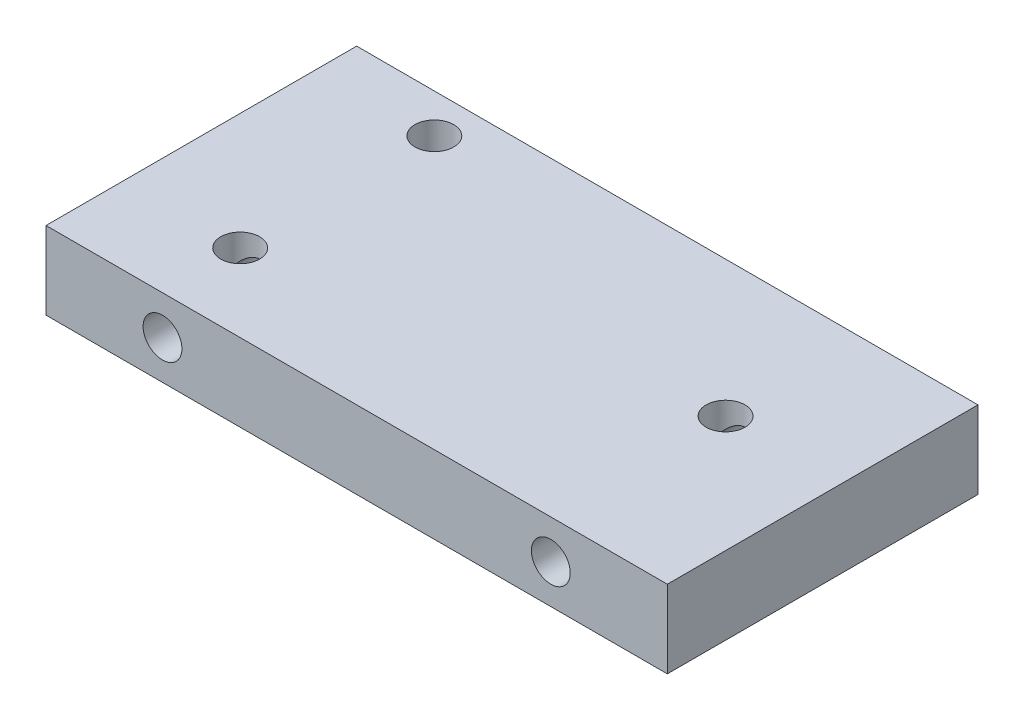
ISO-10303-21;
HEADER;
FILE_DESCRIPTION(('STEP AP214'),'2;1');
FILE_NAME('part.step','',(''),(''),'','','');
FILE_SCHEMA(('AUTOMOTIVE_DESIGN { 1 0 10303 214 1 1 1 1 }'));
ENDSEC;
DATA;
#1=APPLICATION_CONTEXT('core data for automotive mechanical design processes');
#2=APPLICATION_PROTOCOL_DEFINITION('international standard','automotive_design',2000,#1);
#3=PRODUCT_CONTEXT('',#1,'mechanical');
#4=PRODUCT('Part','Part','',(#3));
#5=PRODUCT_RELATED_PRODUCT_CATEGORY('part','',(#4));
#6=PRODUCT_DEFINITION_FORMATION('','',#4);
#7=PRODUCT_DEFINITION_CONTEXT('part definition',#1,'design');
#8=PRODUCT_DEFINITION('design','',#6,#7);
#9=PRODUCT_DEFINITION_SHAPE('','',#8);
#10=(LENGTH_UNIT() NAMED_UNIT(*) SI_UNIT(.MILLI.,.METRE.));
#11=(NAMED_UNIT(*) PLANE_ANGLE_UNIT() SI_UNIT($,.RADIAN.));
#12=(NAMED_UNIT(*) SI_UNIT($,.STERADIAN.) SOLID_ANGLE_UNIT());
#13=UNCERTAINTY_MEASURE_WITH_UNIT(LENGTH_MEASURE(1.E-05),#10,'distance_accuracy_value','');
#14=(GEOMETRIC_REPRESENTATION_CONTEXT(3) GLOBAL_UNCERTAINTY_ASSIGNED_CONTEXT((#13)) GLOBAL_UNIT_ASSIGNED_CONTEXT((#10,
#11,#12)) REPRESENTATION_CONTEXT('',''));
#15=CARTESIAN_POINT('',(0.,0.,0.));
#16=DIRECTION('',(0.,0.,1.));
#17=DIRECTION('',(1.,0.,0.));
#18=AXIS2_PLACEMENT_3D('',#15,#16,#17);
#19=CARTESIAN_POINT('',(-82.95230410634,25.,-61.5815341004754));
#20=DIRECTION('',(1.,0.,0.));
#21=DIRECTION('',(0.,0.,-1.));
#22=AXIS2_PLACEMENT_3D('',#19,#20,#21);
#23=PLANE('',#22);
#24=DIRECTION('',(0.,0.,1.));
#25=VECTOR('',#24,1.);
#26=CARTESIAN_POINT('',(-82.95230410634,0.,-61.5815341004754));
#27=LINE('',#26,#25);
#28=CARTESIAN_POINT('',(-82.95230410634,0.,-61.5815341004754));
#29=VERTEX_POINT('',#28);
#30=CARTESIAN_POINT('',(-82.95230410634,0.,38.4184658995246));
#31=VERTEX_POINT('',#30);
#32=EDGE_CURVE('E141',#29,#31,#27,.T.);
#33=ORIENTED_EDGE('',*,*,#32,.T.);
#34=DIRECTION('',(0.,-1.,0.));
#35=VECTOR('',#34,1.);
#36=CARTESIAN_POINT('',(-82.95230410634,25.,38.4184658995246));
#37=LINE('',#36,#35);
#38=CARTESIAN_POINT('',(-82.95230410634,25.,38.4184658995246));
#39=VERTEX_POINT('',#38);
#40=EDGE_CURVE('E168',#39,#31,#37,.T.);
#41=ORIENTED_EDGE('',*,*,#40,.F.);
#42=DIRECTION('',(0.,0.,1.));
#43=VECTOR('',#42,1.);
#44=CARTESIAN_POINT('',(-82.95230410634,25.,-61.5815341004754));
#45=LINE('',#44,#43);
#46=CARTESIAN_POINT('',(-82.95230410634,25.,-61.5815341004754));
#47=VERTEX_POINT('',#46);
#48=EDGE_CURVE('E142',#47,#39,#45,.T.);
#49=ORIENTED_EDGE('',*,*,#48,.F.);
#50=DIRECTION('',(0.,-1.,0.));
#51=VECTOR('',#50,1.);
#52=CARTESIAN_POINT('',(-82.95230410634,25.,-61.5815341004754));
#53=LINE('',#52,#51);
#54=EDGE_CURVE('E152',#47,#29,#53,.T.);
#55=ORIENTED_EDGE('',*,*,#54,.T.);
#56=EDGE_LOOP('',(#33,#41,#49,#55));
#57=FACE_BOUND('',#56,.T.);
#58=ADVANCED_FACE('F33',(#57),#23,.F.);
#59=CARTESIAN_POINT('',(-82.95230410634,25.,38.4184658995246));
#60=DIRECTION('',(0.,0.,-1.));
#61=DIRECTION('',(-1.,0.,0.));
#62=AXIS2_PLACEMENT_3D('',#59,#60,#61);
#63=PLANE('',#62);
#64=CARTESIAN_POINT('',(79.54769589366,12.5,38.4184658995246));
#65=DIRECTION('',(0.,0.,1.));
#66=DIRECTION('',(1.,0.,0.));
#67=AXIS2_PLACEMENT_3D('',#64,#65,#66);
#68=CIRCLE('',#67,6.25);
#69=CARTESIAN_POINT('',(85.79769589366,12.5,38.4184658995246));
#70=VERTEX_POINT('',#69);
#71=EDGE_CURVE('E133',#70,#70,#68,.T.);
#72=ORIENTED_EDGE('',*,*,#71,.F.);
#73=EDGE_LOOP('',(#72));
#74=FACE_BOUND('',#73,.T.);
#75=CARTESIAN_POINT('',(-45.45230410634,12.5,38.4184658995246));
#76=DIRECTION('',(0.,0.,1.));
#77=DIRECTION('',(1.,0.,0.));
#78=AXIS2_PLACEMENT_3D('',#75,#76,#77);
#79=CIRCLE('',#78,6.25);
#80=CARTESIAN_POINT('',(-39.20230410634,12.5,38.4184658995246));
#81=VERTEX_POINT('',#80);
#82=EDGE_CURVE('E136',#81,#81,#79,.T.);
#83=ORIENTED_EDGE('',*,*,#82,.F.);
#84=EDGE_LOOP('',(#83));
#85=FACE_BOUND('',#84,.T.);
#86=DIRECTION('',(1.,0.,0.));
#87=VECTOR('',#86,1.);
#88=CARTESIAN_POINT('',(-82.95230410634,0.,38.4184658995246));
#89=LINE('',#88,#87);
#90=CARTESIAN_POINT('',(117.04769589366,0.,38.4184658995246));
#91=VERTEX_POINT('',#90);
#92=EDGE_CURVE('E155',#31,#91,#89,.T.);
#93=ORIENTED_EDGE('',*,*,#92,.T.);
#94=DIRECTION('',(0.,-1.,0.));
#95=VECTOR('',#94,1.);
#96=CARTESIAN_POINT('',(117.04769589366,25.,38.4184658995246));
#97=LINE('',#96,#95);
#98=CARTESIAN_POINT('',(117.04769589366,25.,38.4184658995246));
#99=VERTEX_POINT('',#98);
#100=EDGE_CURVE('E165',#99,#91,#97,.T.);
#101=ORIENTED_EDGE('',*,*,#100,.F.);
#102=DIRECTION('',(1.,0.,0.));
#103=VECTOR('',#102,1.);
#104=CARTESIAN_POINT('',(-82.95230410634,25.,38.4184658995246));
#105=LINE('',#104,#103);
#106=EDGE_CURVE('E145',#39,#99,#105,.T.);
#107=ORIENTED_EDGE('',*,*,#106,.F.);
#108=ORIENTED_EDGE('',*,*,#40,.T.);
#109=EDGE_LOOP('',(#93,#101,#107,#108));
#110=FACE_BOUND('',#109,.T.);
#111=ADVANCED_FACE('F228',(#74,#85,#110),#63,.F.);
#112=CARTESIAN_POINT('',(117.04769589366,25.,-61.5815341004754));
#113=DIRECTION('',(-1.,0.,0.));
#114=DIRECTION('',(0.,0.,1.));
#115=AXIS2_PLACEMENT_3D('',#112,#113,#114);
#116=PLANE('',#115);
#117=DIRECTION('',(0.,0.,-1.));
#118=VECTOR('',#117,1.);
#119=CARTESIAN_POINT('',(117.04769589366,0.,-61.5815341004754));
#120=LINE('',#119,#118);
#121=CARTESIAN_POINT('',(117.04769589366,0.,-61.5815341004754));
#122=VERTEX_POINT('',#121);
#123=EDGE_CURVE('E157',#91,#122,#120,.T.);
#124=ORIENTED_EDGE('',*,*,#123,.T.);
#125=DIRECTION('',(0.,-1.,0.));
#126=VECTOR('',#125,1.);
#127=CARTESIAN_POINT('',(117.04769589366,25.,-61.5815341004754));
#128=LINE('',#127,#126);
#129=CARTESIAN_POINT('',(117.04769589366,25.,-61.5815341004754));
#130=VERTEX_POINT('',#129);
#131=EDGE_CURVE('E162',#130,#122,#128,.T.);
#132=ORIENTED_EDGE('',*,*,#131,.F.);
#133=DIRECTION('',(0.,0.,-1.));
#134=VECTOR('',#133,1.);
#135=CARTESIAN_POINT('',(117.04769589366,25.,-61.5815341004754));
#136=LINE('',#135,#134);
#137=EDGE_CURVE('E148',#99,#130,#136,.T.);
#138=ORIENTED_EDGE('',*,*,#137,.F.);
#139=ORIENTED_EDGE('',*,*,#100,.T.);
#140=EDGE_LOOP('',(#124,#132,#138,#139));
#141=FACE_BOUND('',#140,.T.);
#142=ADVANCED_FACE('F233',(#141),#116,.F.);
#143=CARTESIAN_POINT('',(-82.95230410634,25.,-61.5815341004754));
#144=DIRECTION('',(0.,0.,1.));
#145=DIRECTION('',(1.,0.,0.));
#146=AXIS2_PLACEMENT_3D('',#143,#144,#145);
#147=PLANE('',#146);
#148=DIRECTION('',(-1.,0.,0.));
#149=VECTOR('',#148,1.);
#150=CARTESIAN_POINT('',(-82.95230410634,0.,-61.5815341004754));
#151=LINE('',#150,#149);
#152=EDGE_CURVE('E146',#122,#29,#151,.T.);
#153=ORIENTED_EDGE('',*,*,#152,.T.);
#154=ORIENTED_EDGE('',*,*,#54,.F.);
#155=DIRECTION('',(-1.,0.,0.));
#156=VECTOR('',#155,1.);
#157=CARTESIAN_POINT('',(-82.95230410634,25.,-61.5815341004754));
#158=LINE('',#157,#156);
#159=EDGE_CURVE('E150',#130,#47,#158,.T.);
#160=ORIENTED_EDGE('',*,*,#159,.F.);
#161=ORIENTED_EDGE('',*,*,#131,.T.);
#162=EDGE_LOOP('',(#153,#154,#160,#161));
#163=FACE_BOUND('',#162,.T.);
#164=ADVANCED_FACE('F251',(#163),#147,.F.);
#165=CARTESIAN_POINT('',(0.,25.,0.));
#166=DIRECTION('',(0.,1.,0.));
#167=DIRECTION('',(0.,0.,1.));
#168=AXIS2_PLACEMENT_3D('',#165,#166,#167);
#169=PLANE('',#168);
#170=CARTESIAN_POINT('',(-45.45230410634,25.,-49.0815341004754));
#171=DIRECTION('',(0.,1.,0.));
#172=DIRECTION('',(0.,0.,1.));
#173=AXIS2_PLACEMENT_3D('',#170,#171,#172);
#174=CIRCLE('',#173,6.25);
#175=CARTESIAN_POINT('',(-45.45230410634,25.,-42.8315341004754));
#176=VERTEX_POINT('',#175);
#177=EDGE_CURVE('E113',#176,#176,#174,.T.);
#178=ORIENTED_EDGE('',*,*,#177,.F.);
#179=EDGE_LOOP('',(#178));
#180=FACE_BOUND('',#179,.T.);
#181=CARTESIAN_POINT('',(79.54769589366,25.,-17.8315341004754));
#182=DIRECTION('',(0.,1.,0.));
#183=DIRECTION('',(0.,0.,1.));
#184=AXIS2_PLACEMENT_3D('',#181,#182,#183);
#185=CIRCLE('',#184,6.25);
#186=CARTESIAN_POINT('',(79.54769589366,25.,-11.5815341004754));
#187=VERTEX_POINT('',#186);
#188=EDGE_CURVE('E119',#187,#187,#185,.T.);
#189=ORIENTED_EDGE('',*,*,#188,.F.);
#190=EDGE_LOOP('',(#189));
#191=FACE_BOUND('',#190,.T.);
#192=CARTESIAN_POINT('',(-45.45230410634,25.,13.4184658995246));
#193=DIRECTION('',(0.,1.,0.));
#194=DIRECTION('',(0.,0.,1.));
#195=AXIS2_PLACEMENT_3D('',#192,#193,#194);
#196=CIRCLE('',#195,6.25);
#197=CARTESIAN_POINT('',(-45.45230410634,25.,19.6684658995246));
#198=VERTEX_POINT('',#197);
#199=EDGE_CURVE('E122',#198,#198,#196,.T.);
#200=ORIENTED_EDGE('',*,*,#199,.F.);
#201=EDGE_LOOP('',(#200));
#202=FACE_BOUND('',#201,.T.);
#203=ORIENTED_EDGE('',*,*,#48,.T.);
#204=ORIENTED_EDGE('',*,*,#106,.T.);
#205=ORIENTED_EDGE('',*,*,#137,.T.);
#206=ORIENTED_EDGE('',*,*,#159,.T.);
#207=EDGE_LOOP('',(#203,#204,#205,#206));
#208=FACE_BOUND('',#207,.T.);
#209=ADVANCED_FACE('F247',(#180,#191,#202,#208),#169,.T.);
#210=CARTESIAN_POINT('',(0.,0.,0.));
#211=DIRECTION('',(0.,1.,0.));
#212=DIRECTION('',(0.,0.,1.));
#213=AXIS2_PLACEMENT_3D('',#210,#211,#212);
#214=PLANE('',#213);
#215=ORIENTED_EDGE('',*,*,#32,.F.);
#216=ORIENTED_EDGE('',*,*,#152,.F.);
#217=ORIENTED_EDGE('',*,*,#123,.F.);
#218=ORIENTED_EDGE('',*,*,#92,.F.);
#219=EDGE_LOOP('',(#215,#216,#217,#218));
#220=FACE_BOUND('',#219,.T.);
#221=ADVANCED_FACE('F241',(#220),#214,.F.);
#222=CARTESIAN_POINT('',(-45.45230410634,12.5,-49.0815341004754));
#223=DIRECTION('',(0.,0.,1.));
#224=DIRECTION('',(1.,0.,0.));
#225=AXIS2_PLACEMENT_3D('',#222,#223,#224);
#226=CYLINDRICAL_SURFACE('',#225,6.25);
#227=CARTESIAN_POINT('',(-45.45230410634,12.5,13.4184658995246));
#228=DIRECTION('',(0.,0.707106781186547,0.707106781186547));
#229=DIRECTION('',(0.,-0.707106781186547,0.707106781186547));
#230=AXIS2_PLACEMENT_3D('',#227,#228,#229);
#231=ELLIPSE('',#230,8.83883476483185,6.25);
#232=CARTESIAN_POINT('',(-45.45230410634,6.25,19.6684658995246));
#233=VERTEX_POINT('',#232);
#234=CARTESIAN_POINT('',(-51.70230410634,12.5,13.4184658995246));
#235=VERTEX_POINT('',#234);
#236=EDGE_CURVE('E178',#233,#235,#231,.F.);
#237=ORIENTED_EDGE('',*,*,#236,.T.);
#238=CARTESIAN_POINT('',(-45.45230410634,12.5,13.4184658995246));
#239=DIRECTION('',(0.,-0.707106781186547,0.707106781186547));
#240=DIRECTION('',(0.,0.707106781186547,0.707106781186547));
#241=AXIS2_PLACEMENT_3D('',#238,#239,#240);
#242=ELLIPSE('',#241,8.83883476483185,6.25);
#243=CARTESIAN_POINT('',(-39.20230410634,12.5,13.4184658995246));
#244=VERTEX_POINT('',#243);
#245=EDGE_CURVE('E182',#235,#244,#242,.F.);
#246=ORIENTED_EDGE('',*,*,#245,.T.);
#247=EDGE_CURVE('E181',#244,#233,#231,.F.);
#248=ORIENTED_EDGE('',*,*,#247,.T.);
#249=EDGE_LOOP('',(#237,#246,#248));
#250=FACE_BOUND('',#249,.T.);
#251=ORIENTED_EDGE('',*,*,#82,.T.);
#252=EDGE_LOOP('',(#251));
#253=FACE_BOUND('',#252,.T.);
#254=ADVANCED_FACE('F262',(#250,#253),#226,.F.);
#255=CARTESIAN_POINT('',(79.54769589366,12.5,-49.0815341004754));
#256=DIRECTION('',(0.,0.,1.));
#257=DIRECTION('',(1.,0.,0.));
#258=AXIS2_PLACEMENT_3D('',#255,#256,#257);
#259=CYLINDRICAL_SURFACE('',#258,6.25);
#260=CARTESIAN_POINT('',(79.54769589366,12.5,-17.8315341004754));
#261=DIRECTION('',(0.,0.707106781186547,0.707106781186547));
#262=DIRECTION('',(0.,-0.707106781186547,0.707106781186547));
#263=AXIS2_PLACEMENT_3D('',#260,#261,#262);
#264=ELLIPSE('',#263,8.83883476483185,6.25);
#265=CARTESIAN_POINT('',(79.54769589366,6.25,-11.5815341004754));
#266=VERTEX_POINT('',#265);
#267=CARTESIAN_POINT('',(73.29769589366,12.5,-17.8315341004754));
#268=VERTEX_POINT('',#267);
#269=EDGE_CURVE('E190',#266,#268,#264,.F.);
#270=ORIENTED_EDGE('',*,*,#269,.T.);
#271=CARTESIAN_POINT('',(79.54769589366,12.5,-17.8315341004754));
#272=DIRECTION('',(0.,-0.707106781186547,0.707106781186547));
#273=DIRECTION('',(0.,0.707106781186547,0.707106781186547));
#274=AXIS2_PLACEMENT_3D('',#271,#272,#273);
#275=ELLIPSE('',#274,8.83883476483185,6.25);
#276=CARTESIAN_POINT('',(85.79769589366,12.5,-17.8315341004754));
#277=VERTEX_POINT('',#276);
#278=EDGE_CURVE('E54',#268,#277,#275,.F.);
#279=ORIENTED_EDGE('',*,*,#278,.T.);
#280=EDGE_CURVE('E192',#277,#266,#264,.F.);
#281=ORIENTED_EDGE('',*,*,#280,.T.);
#282=EDGE_LOOP('',(#270,#279,#281));
#283=FACE_BOUND('',#282,.T.);
#284=ORIENTED_EDGE('',*,*,#71,.T.);
#285=EDGE_LOOP('',(#284));
#286=FACE_BOUND('',#285,.T.);
#287=ADVANCED_FACE('F195',(#283,#286),#259,.F.);
#288=CARTESIAN_POINT('',(-45.45230410634,6.25,13.4184658995246));
#289=DIRECTION('',(0.,1.,0.));
#290=DIRECTION('',(0.,0.,1.));
#291=AXIS2_PLACEMENT_3D('',#288,#289,#290);
#292=CYLINDRICAL_SURFACE('',#291,6.25);
#293=ORIENTED_EDGE('',*,*,#199,.T.);
#294=EDGE_LOOP('',(#293));
#295=FACE_BOUND('',#294,.T.);
#296=ORIENTED_EDGE('',*,*,#245,.F.);
#297=CARTESIAN_POINT('',(-45.45230410634,12.5,13.4184658995246));
#298=DIRECTION('',(0.,0.707106781186547,0.707106781186547));
#299=DIRECTION('',(0.,-0.707106781186547,0.707106781186547));
#300=AXIS2_PLACEMENT_3D('',#297,#298,#299);
#301=ELLIPSE('',#300,8.83883476483185,6.25);
#302=EDGE_CURVE('E174',#244,#235,#301,.T.);
#303=ORIENTED_EDGE('',*,*,#302,.F.);
#304=EDGE_LOOP('',(#296,#303));
#305=FACE_BOUND('',#304,.T.);
#306=ADVANCED_FACE('F272',(#295,#305),#292,.F.);
#307=CARTESIAN_POINT('',(-45.45230410634,12.5,-49.0815341004754));
#308=DIRECTION('',(0.,-0.707106781186547,0.707106781186547));
#309=DIRECTION('',(0.,0.707106781186547,0.707106781186547));
#310=AXIS2_PLACEMENT_3D('',#307,#308,#309);
#311=ELLIPSE('',#310,8.83883476483184,6.25);
#312=CARTESIAN_POINT('',(-51.70230410634,12.5,-49.0815341004754));
#313=VERTEX_POINT('',#312);
#314=CARTESIAN_POINT('',(-39.20230410634,12.5,-49.0815341004754));
#315=VERTEX_POINT('',#314);
#316=EDGE_CURVE('E36',#313,#315,#311,.F.);
#317=ORIENTED_EDGE('',*,*,#316,.T.);
#318=CARTESIAN_POINT('',(-45.45230410634,12.5,-49.0815341004754));
#319=DIRECTION('',(0.,0.707106781186547,0.707106781186547));
#320=DIRECTION('',(0.,-0.707106781186547,0.707106781186547));
#321=AXIS2_PLACEMENT_3D('',#318,#319,#320);
#322=ELLIPSE('',#321,8.83883476483184,6.25);
#323=CARTESIAN_POINT('',(-45.45230410634,6.25,-42.8315341004754));
#324=VERTEX_POINT('',#323);
#325=EDGE_CURVE('E11',#315,#324,#322,.F.);
#326=ORIENTED_EDGE('',*,*,#325,.T.);
#327=EDGE_CURVE('E41',#324,#313,#322,.F.);
#328=ORIENTED_EDGE('',*,*,#327,.T.);
#329=EDGE_LOOP('',(#317,#326,#328));
#330=FACE_BOUND('',#329,.T.);
#331=ORIENTED_EDGE('',*,*,#302,.T.);
#332=CARTESIAN_POINT('',(-45.45230410634,12.5,13.4184658995246));
#333=DIRECTION('',(0.,-0.707106781186547,0.707106781186547));
#334=DIRECTION('',(0.,0.707106781186547,0.707106781186547));
#335=AXIS2_PLACEMENT_3D('',#332,#333,#334);
#336=ELLIPSE('',#335,8.83883476483185,6.25);
#337=CARTESIAN_POINT('',(-45.45230410634,6.25,7.16846589952457));
#338=VERTEX_POINT('',#337);
#339=EDGE_CURVE('E175',#235,#338,#336,.T.);
#340=ORIENTED_EDGE('',*,*,#339,.T.);
#341=EDGE_CURVE('E171',#338,#244,#336,.T.);
#342=ORIENTED_EDGE('',*,*,#341,.T.);
#343=EDGE_LOOP('',(#331,#340,#342));
#344=FACE_BOUND('',#343,.T.);
#345=ADVANCED_FACE('F268',(#330,#344),#226,.F.);
#346=CARTESIAN_POINT('',(-45.45230410634,6.25,13.4184658995246));
#347=DIRECTION('',(0.,1.,0.));
#348=DIRECTION('',(0.,0.,1.));
#349=AXIS2_PLACEMENT_3D('',#346,#347,#348);
#350=CIRCLE('',#349,6.25);
#351=EDGE_CURVE('E130',#338,#233,#350,.T.);
#352=ORIENTED_EDGE('',*,*,#351,.F.);
#353=ORIENTED_EDGE('',*,*,#339,.F.);
#354=ORIENTED_EDGE('',*,*,#236,.F.);
#355=EDGE_LOOP('',(#352,#353,#354));
#356=FACE_BOUND('',#355,.T.);
#357=ADVANCED_FACE('F273',(#356),#292,.F.);
#358=ORIENTED_EDGE('',*,*,#341,.F.);
#359=EDGE_CURVE('E126',#233,#338,#350,.T.);
#360=ORIENTED_EDGE('',*,*,#359,.F.);
#361=ORIENTED_EDGE('',*,*,#247,.F.);
#362=EDGE_LOOP('',(#358,#360,#361));
#363=FACE_BOUND('',#362,.T.);
#364=ADVANCED_FACE('F219',(#363),#292,.F.);
#365=CARTESIAN_POINT('',(0.,6.25,0.));
#366=DIRECTION('',(0.,1.,0.));
#367=DIRECTION('',(0.,0.,1.));
#368=AXIS2_PLACEMENT_3D('',#365,#366,#367);
#369=PLANE('',#368);
#370=ORIENTED_EDGE('',*,*,#351,.T.);
#371=ORIENTED_EDGE('',*,*,#359,.T.);
#372=EDGE_LOOP('',(#370,#371));
#373=FACE_BOUND('',#372,.T.);
#374=ADVANCED_FACE('F210',(#373),#369,.T.);
#375=CARTESIAN_POINT('',(79.54769589366,6.25,-17.8315341004754));
#376=DIRECTION('',(0.,1.,0.));
#377=DIRECTION('',(0.,0.,1.));
#378=AXIS2_PLACEMENT_3D('',#375,#376,#377);
#379=CYLINDRICAL_SURFACE('',#378,6.25);
#380=ORIENTED_EDGE('',*,*,#188,.T.);
#381=EDGE_LOOP('',(#380));
#382=FACE_BOUND('',#381,.T.);
#383=ORIENTED_EDGE('',*,*,#278,.F.);
#384=CARTESIAN_POINT('',(79.54769589366,12.5,-17.8315341004754));
#385=DIRECTION('',(0.,0.707106781186547,0.707106781186547));
#386=DIRECTION('',(0.,-0.707106781186547,0.707106781186547));
#387=AXIS2_PLACEMENT_3D('',#384,#385,#386);
#388=ELLIPSE('',#387,8.83883476483185,6.25);
#389=EDGE_CURVE('E187',#277,#268,#388,.T.);
#390=ORIENTED_EDGE('',*,*,#389,.F.);
#391=EDGE_LOOP('',(#383,#390));
#392=FACE_BOUND('',#391,.T.);
#393=ADVANCED_FACE('F207',(#382,#392),#379,.F.);
#394=CARTESIAN_POINT('',(79.54769589366,12.5,-49.0815341004754));
#395=DIRECTION('',(0.,0.,1.));
#396=DIRECTION('',(1.,0.,0.));
#397=AXIS2_PLACEMENT_3D('',#394,#395,#396);
#398=PLANE('',#397);
#399=CARTESIAN_POINT('',(79.54769589366,12.5,-49.0815341004754));
#400=DIRECTION('',(0.,0.,1.));
#401=DIRECTION('',(1.,0.,0.));
#402=AXIS2_PLACEMENT_3D('',#399,#400,#401);
#403=CIRCLE('',#402,6.25);
#404=CARTESIAN_POINT('',(85.79769589366,12.5,-49.0815341004754));
#405=VERTEX_POINT('',#404);
#406=EDGE_CURVE('E129',#405,#405,#403,.T.);
#407=ORIENTED_EDGE('',*,*,#406,.T.);
#408=EDGE_LOOP('',(#407));
#409=FACE_BOUND('',#408,.T.);
#410=ADVANCED_FACE('F209',(#409),#398,.T.);
#411=ORIENTED_EDGE('',*,*,#406,.F.);
#412=EDGE_LOOP('',(#411));
#413=FACE_BOUND('',#412,.T.);
#414=ORIENTED_EDGE('',*,*,#389,.T.);
#415=CARTESIAN_POINT('',(79.54769589366,12.5,-17.8315341004754));
#416=DIRECTION('',(0.,-0.707106781186547,0.707106781186547));
#417=DIRECTION('',(0.,0.707106781186547,0.707106781186547));
#418=AXIS2_PLACEMENT_3D('',#415,#416,#417);
#419=ELLIPSE('',#418,8.83883476483185,6.25);
#420=CARTESIAN_POINT('',(79.54769589366,6.25,-24.0815341004754));
#421=VERTEX_POINT('',#420);
#422=EDGE_CURVE('E110',#268,#421,#419,.T.);
#423=ORIENTED_EDGE('',*,*,#422,.T.);
#424=EDGE_CURVE('E184',#421,#277,#419,.T.);
#425=ORIENTED_EDGE('',*,*,#424,.T.);
#426=EDGE_LOOP('',(#414,#423,#425));
#427=FACE_BOUND('',#426,.T.);
#428=ADVANCED_FACE('F202',(#413,#427),#259,.F.);
#429=CARTESIAN_POINT('',(79.54769589366,6.25,-17.8315341004754));
#430=DIRECTION('',(0.,1.,0.));
#431=DIRECTION('',(0.,0.,1.));
#432=AXIS2_PLACEMENT_3D('',#429,#430,#431);
#433=CIRCLE('',#432,6.25);
#434=EDGE_CURVE('E116',#421,#266,#433,.T.);
#435=ORIENTED_EDGE('',*,*,#434,.F.);
#436=ORIENTED_EDGE('',*,*,#422,.F.);
#437=ORIENTED_EDGE('',*,*,#269,.F.);
#438=EDGE_LOOP('',(#435,#436,#437));
#439=FACE_BOUND('',#438,.T.);
#440=ADVANCED_FACE('F204',(#439),#379,.F.);
#441=ORIENTED_EDGE('',*,*,#424,.F.);
#442=EDGE_CURVE('E123',#266,#421,#433,.T.);
#443=ORIENTED_EDGE('',*,*,#442,.F.);
#444=ORIENTED_EDGE('',*,*,#280,.F.);
#445=EDGE_LOOP('',(#441,#443,#444));
#446=FACE_BOUND('',#445,.T.);
#447=ADVANCED_FACE('F199',(#446),#379,.F.);
#448=CARTESIAN_POINT('',(0.,6.25,0.));
#449=DIRECTION('',(0.,1.,0.));
#450=DIRECTION('',(0.,0.,1.));
#451=AXIS2_PLACEMENT_3D('',#448,#449,#450);
#452=PLANE('',#451);
#453=ORIENTED_EDGE('',*,*,#434,.T.);
#454=ORIENTED_EDGE('',*,*,#442,.T.);
#455=EDGE_LOOP('',(#453,#454));
#456=FACE_BOUND('',#455,.T.);
#457=ADVANCED_FACE('F226',(#456),#452,.T.);
#458=CARTESIAN_POINT('',(-45.45230410634,6.25,-49.0815341004754));
#459=DIRECTION('',(0.,1.,0.));
#460=DIRECTION('',(0.,0.,1.));
#461=AXIS2_PLACEMENT_3D('',#458,#459,#460);
#462=CYLINDRICAL_SURFACE('',#461,6.25);
#463=ORIENTED_EDGE('',*,*,#177,.T.);
#464=EDGE_LOOP('',(#463));
#465=FACE_BOUND('',#464,.T.);
#466=ORIENTED_EDGE('',*,*,#316,.F.);
#467=ORIENTED_EDGE('',*,*,#327,.F.);
#468=CARTESIAN_POINT('',(-45.45230410634,6.25,-49.0815341004754));
#469=DIRECTION('',(0.,1.,0.));
#470=DIRECTION('',(0.,0.,1.));
#471=AXIS2_PLACEMENT_3D('',#468,#469,#470);
#472=CIRCLE('',#471,6.25);
#473=EDGE_CURVE('E108',#324,#324,#472,.T.);
#474=ORIENTED_EDGE('',*,*,#473,.F.);
#475=ORIENTED_EDGE('',*,*,#325,.F.);
#476=EDGE_LOOP('',(#466,#467,#474,#475));
#477=FACE_BOUND('',#476,.T.);
#478=ADVANCED_FACE('F107',(#465,#477),#462,.F.);
#479=CARTESIAN_POINT('',(-45.45230410634,6.25,-49.0815341004754));
#480=DIRECTION('',(0.,1.,0.));
#481=DIRECTION('',(0.,0.,1.));
#482=AXIS2_PLACEMENT_3D('',#479,#480,#481);
#483=PLANE('',#482);
#484=ORIENTED_EDGE('',*,*,#473,.T.);
#485=EDGE_LOOP('',(#484));
#486=FACE_BOUND('',#485,.T.);
#487=ADVANCED_FACE('F112',(#486),#483,.T.);
#488=CLOSED_SHELL('',(#58,#111,#142,#164,#209,#221,#254,#287,#306,#345,#357,#364,#374,#393,#410,
#428,#440,#447,#457,#478,#487));
#489=MANIFOLD_SOLID_BREP('B2',#488);
#490=ADVANCED_BREP_SHAPE_REPRESENTATION('',(#18,#489),#14);
#491=SHAPE_DEFINITION_REPRESENTATION(#9,#490);
ENDSEC;
END-ISO-10303-21;
